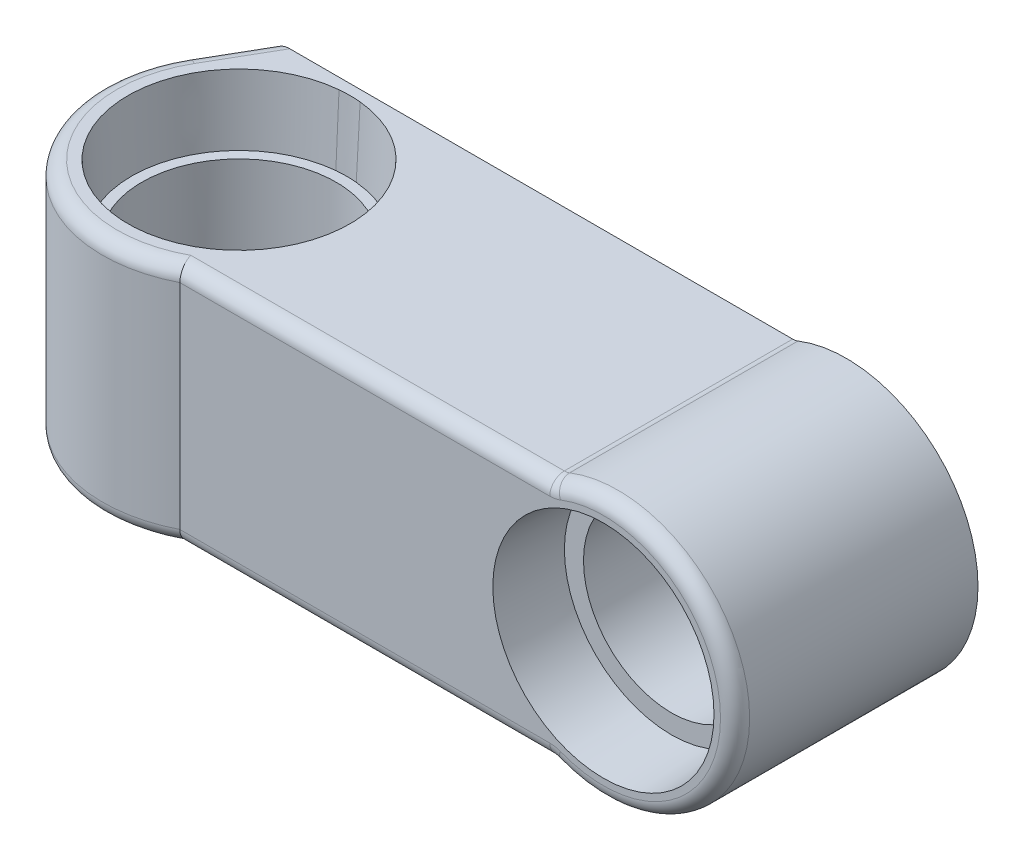
ISO-10303-21;
HEADER;
FILE_DESCRIPTION(('STEP AP214'),'2;1');
FILE_NAME('part.step','',(''),(''),'','','');
FILE_SCHEMA(('AUTOMOTIVE_DESIGN { 1 0 10303 214 1 1 1 1 }'));
ENDSEC;
DATA;
#1=APPLICATION_CONTEXT('core data for automotive mechanical design processes');
#2=APPLICATION_PROTOCOL_DEFINITION('international standard','automotive_design',2000,#1);
#3=PRODUCT_CONTEXT('',#1,'mechanical');
#4=PRODUCT('Part','Part','',(#3));
#5=PRODUCT_RELATED_PRODUCT_CATEGORY('part','',(#4));
#6=PRODUCT_DEFINITION_FORMATION('','',#4);
#7=PRODUCT_DEFINITION_CONTEXT('part definition',#1,'design');
#8=PRODUCT_DEFINITION('design','',#6,#7);
#9=PRODUCT_DEFINITION_SHAPE('','',#8);
#10=(LENGTH_UNIT() NAMED_UNIT(*) SI_UNIT(.MILLI.,.METRE.));
#11=(NAMED_UNIT(*) PLANE_ANGLE_UNIT() SI_UNIT($,.RADIAN.));
#12=(NAMED_UNIT(*) SI_UNIT($,.STERADIAN.) SOLID_ANGLE_UNIT());
#13=UNCERTAINTY_MEASURE_WITH_UNIT(LENGTH_MEASURE(1.E-05),#10,'distance_accuracy_value','');
#14=(GEOMETRIC_REPRESENTATION_CONTEXT(3) GLOBAL_UNCERTAINTY_ASSIGNED_CONTEXT((#13)) GLOBAL_UNIT_ASSIGNED_CONTEXT((#10,
#11,#12)) REPRESENTATION_CONTEXT('',''));
#15=CARTESIAN_POINT('',(0.,0.,0.));
#16=DIRECTION('',(0.,0.,1.));
#17=DIRECTION('',(1.,0.,0.));
#18=AXIS2_PLACEMENT_3D('',#15,#16,#17);
#19=CARTESIAN_POINT('',(50.,0.,25.));
#20=DIRECTION('',(0.,0.,-1.));
#21=DIRECTION('',(-1.,0.,0.));
#22=AXIS2_PLACEMENT_3D('',#19,#20,#21);
#23=CYLINDRICAL_SURFACE('',#22,9.05);
#24=CARTESIAN_POINT('',(50.,0.,18.));
#25=DIRECTION('',(0.,0.,1.));
#26=DIRECTION('',(1.,0.,0.));
#27=AXIS2_PLACEMENT_3D('',#24,#25,#26);
#28=CIRCLE('',#27,9.05);
#29=CARTESIAN_POINT('',(59.05,0.,18.));
#30=VERTEX_POINT('',#29);
#31=EDGE_CURVE('E469',#30,#30,#28,.F.);
#32=ORIENTED_EDGE('',*,*,#31,.F.);
#33=EDGE_LOOP('',(#32));
#34=FACE_BOUND('',#33,.T.);
#35=CARTESIAN_POINT('',(50.,0.,7.));
#36=DIRECTION('',(0.,0.,-1.));
#37=DIRECTION('',(-1.,0.,0.));
#38=AXIS2_PLACEMENT_3D('',#35,#36,#37);
#39=CIRCLE('',#38,9.05);
#40=CARTESIAN_POINT('',(40.95,0.,7.));
#41=VERTEX_POINT('',#40);
#42=EDGE_CURVE('E467',#41,#41,#39,.F.);
#43=ORIENTED_EDGE('',*,*,#42,.F.);
#44=EDGE_LOOP('',(#43));
#45=FACE_BOUND('',#44,.T.);
#46=ADVANCED_FACE('F38',(#34,#45),#23,.F.);
#47=CARTESIAN_POINT('',(0.,-13.5504731747743,12.5));
#48=DIRECTION('',(0.,1.,0.));
#49=DIRECTION('',(0.,0.,1.));
#50=AXIS2_PLACEMENT_3D('',#47,#48,#49);
#51=CYLINDRICAL_SURFACE('',#50,10.);
#52=CARTESIAN_POINT('',(0.,5.5,12.5));
#53=DIRECTION('',(0.,1.,0.));
#54=DIRECTION('',(0.,0.,1.));
#55=AXIS2_PLACEMENT_3D('',#52,#53,#54);
#56=CIRCLE('',#55,10.);
#57=CARTESIAN_POINT('',(0.,5.5,22.5));
#58=VERTEX_POINT('',#57);
#59=EDGE_CURVE('E393',#58,#58,#56,.T.);
#60=ORIENTED_EDGE('',*,*,#59,.T.);
#61=EDGE_LOOP('',(#60));
#62=FACE_BOUND('',#61,.T.);
#63=CARTESIAN_POINT('',(0.,-5.5,12.5));
#64=DIRECTION('',(0.,-1.,0.));
#65=DIRECTION('',(0.,0.,-1.));
#66=AXIS2_PLACEMENT_3D('',#63,#64,#65);
#67=CIRCLE('',#66,10.);
#68=CARTESIAN_POINT('',(0.,-5.5,2.5));
#69=VERTEX_POINT('',#68);
#70=EDGE_CURVE('E438',#69,#69,#67,.F.);
#71=ORIENTED_EDGE('',*,*,#70,.F.);
#72=EDGE_LOOP('',(#71));
#73=FACE_BOUND('',#72,.T.);
#74=ADVANCED_FACE('F447',(#62,#73),#51,.F.);
#75=CARTESIAN_POINT('',(44.4770931566792,-14.,23.5));
#76=DIRECTION('',(0.,0.,-1.));
#77=DIRECTION('',(-1.,0.,0.));
#78=AXIS2_PLACEMENT_3D('',#75,#76,#77);
#79=TOROIDAL_SURFACE('',#78,3.,1.5);
#80=CARTESIAN_POINT('',(44.4770931566792,-14.,25.));
#81=DIRECTION('',(0.,0.,1.));
#82=DIRECTION('',(0.366970554373467,0.930232558139539,0.));
#83=AXIS2_PLACEMENT_3D('',#80,#81,#82);
#84=CIRCLE('',#83,2.99999999999998);
#85=CARTESIAN_POINT('',(44.4770931566792,-11.,25.));
#86=VERTEX_POINT('',#85);
#87=CARTESIAN_POINT('',(45.5780048197996,-11.2093023255814,25.));
#88=VERTEX_POINT('',#87);
#89=EDGE_CURVE('E293',#86,#88,#84,.F.);
#90=ORIENTED_EDGE('',*,*,#89,.F.);
#91=CARTESIAN_POINT('',(44.4770931566792,-11.,23.5));
#92=DIRECTION('',(1.,0.,0.));
#93=DIRECTION('',(0.,0.,-1.));
#94=AXIS2_PLACEMENT_3D('',#91,#92,#93);
#95=CIRCLE('',#94,1.5);
#96=CARTESIAN_POINT('',(44.4770931566792,-12.5,23.5));
#97=VERTEX_POINT('',#96);
#98=EDGE_CURVE('E300',#97,#86,#95,.F.);
#99=ORIENTED_EDGE('',*,*,#98,.F.);
#100=CARTESIAN_POINT('',(44.4770931566792,-14.,23.5));
#101=DIRECTION('',(0.,0.,-1.));
#102=DIRECTION('',(-1.,0.,0.));
#103=AXIS2_PLACEMENT_3D('',#100,#101,#102);
#104=CIRCLE('',#103,1.5);
#105=CARTESIAN_POINT('',(45.0275489882394,-12.6046511627907,23.5));
#106=VERTEX_POINT('',#105);
#107=EDGE_CURVE('E408',#97,#106,#104,.T.);
#108=ORIENTED_EDGE('',*,*,#107,.T.);
#109=CARTESIAN_POINT('',(45.5780048197996,-11.2093023255814,23.5));
#110=DIRECTION('',(-0.930232558139535,0.366970554373477,0.));
#111=DIRECTION('',(-0.366970554373477,-0.930232558139535,0.));
#112=AXIS2_PLACEMENT_3D('',#109,#110,#111);
#113=CIRCLE('',#112,1.5);
#114=EDGE_CURVE('E314',#88,#106,#113,.F.);
#115=ORIENTED_EDGE('',*,*,#114,.F.);
#116=EDGE_LOOP('',(#90,#99,#108,#115));
#117=FACE_BOUND('',#116,.T.);
#118=ADVANCED_FACE('F416',(#117),#79,.T.);
#119=CARTESIAN_POINT('',(44.4770931566792,14.,23.5));
#120=DIRECTION('',(0.,0.,-1.));
#121=DIRECTION('',(-1.,0.,0.));
#122=AXIS2_PLACEMENT_3D('',#119,#120,#121);
#123=TOROIDAL_SURFACE('',#122,3.00000000000002,1.5);
#124=CARTESIAN_POINT('',(44.4770931566792,14.,25.));
#125=DIRECTION('',(0.,0.,1.));
#126=DIRECTION('',(0.,-1.,0.));
#127=AXIS2_PLACEMENT_3D('',#124,#125,#126);
#128=CIRCLE('',#127,3.00000000000002);
#129=CARTESIAN_POINT('',(45.5780048197996,11.2093023255814,25.));
#130=VERTEX_POINT('',#129);
#131=CARTESIAN_POINT('',(44.4770931566792,11.,25.));
#132=VERTEX_POINT('',#131);
#133=EDGE_CURVE('E284',#130,#132,#128,.F.);
#134=ORIENTED_EDGE('',*,*,#133,.F.);
#135=CARTESIAN_POINT('',(45.5780048197996,11.2093023255814,23.5));
#136=DIRECTION('',(0.930232558139535,0.366970554373476,0.));
#137=DIRECTION('',(-0.366970554373476,0.930232558139535,0.));
#138=AXIS2_PLACEMENT_3D('',#135,#136,#137);
#139=CIRCLE('',#138,1.5);
#140=CARTESIAN_POINT('',(45.0275489882394,12.6046511627907,23.5));
#141=VERTEX_POINT('',#140);
#142=EDGE_CURVE('E318',#141,#130,#139,.T.);
#143=ORIENTED_EDGE('',*,*,#142,.F.);
#144=CARTESIAN_POINT('',(44.4770931566792,14.,23.5));
#145=DIRECTION('',(0.,0.,-1.));
#146=DIRECTION('',(-1.,0.,0.));
#147=AXIS2_PLACEMENT_3D('',#144,#145,#146);
#148=CIRCLE('',#147,1.50000000000002);
#149=CARTESIAN_POINT('',(44.4770931566792,12.5,23.5));
#150=VERTEX_POINT('',#149);
#151=EDGE_CURVE('E298',#141,#150,#148,.T.);
#152=ORIENTED_EDGE('',*,*,#151,.T.);
#153=CARTESIAN_POINT('',(44.4770931566792,11.,23.5));
#154=DIRECTION('',(-1.,0.,0.));
#155=DIRECTION('',(0.,0.,1.));
#156=AXIS2_PLACEMENT_3D('',#153,#154,#155);
#157=CIRCLE('',#156,1.5);
#158=EDGE_CURVE('E296',#132,#150,#157,.T.);
#159=ORIENTED_EDGE('',*,*,#158,.F.);
#160=EDGE_LOOP('',(#134,#143,#152,#159));
#161=FACE_BOUND('',#160,.T.);
#162=ADVANCED_FACE('F246',(#161),#123,.T.);
#163=CARTESIAN_POINT('',(27.2381500888347,0.,25.));
#164=DIRECTION('',(0.,0.,1.));
#165=DIRECTION('',(1.,0.,0.));
#166=AXIS2_PLACEMENT_3D('',#163,#164,#165);
#167=PLANE('',#166);
#168=CARTESIAN_POINT('',(50.,0.,25.));
#169=DIRECTION('',(0.,0.,1.));
#170=DIRECTION('',(1.,0.,0.));
#171=AXIS2_PLACEMENT_3D('',#168,#169,#170);
#172=CIRCLE('',#171,11.381);
#173=CARTESIAN_POINT('',(61.381,0.,25.));
#174=VERTEX_POINT('',#173);
#175=EDGE_CURVE('E488',#174,#174,#172,.F.);
#176=ORIENTED_EDGE('',*,*,#175,.T.);
#177=EDGE_LOOP('',(#176));
#178=FACE_BOUND('',#177,.T.);
#179=DIRECTION('',(0.,-1.,0.));
#180=VECTOR('',#179,1.);
#181=CARTESIAN_POINT('',(6.41502143410293,52.239401102684,25.));
#182=LINE('',#181,#180);
#183=CARTESIAN_POINT('',(6.41502143410293,-11.,25.));
#184=VERTEX_POINT('',#183);
#185=CARTESIAN_POINT('',(6.41502143410293,11.,25.));
#186=VERTEX_POINT('',#185);
#187=EDGE_CURVE('E380',#184,#186,#182,.F.);
#188=ORIENTED_EDGE('',*,*,#187,.F.);
#189=DIRECTION('',(1.,0.,0.));
#190=VECTOR('',#189,1.);
#191=CARTESIAN_POINT('',(13.6190750444174,-11.,25.));
#192=LINE('',#191,#190);
#193=EDGE_CURVE('E304',#86,#184,#192,.F.);
#194=ORIENTED_EDGE('',*,*,#193,.F.);
#195=ORIENTED_EDGE('',*,*,#89,.T.);
#196=CARTESIAN_POINT('',(50.,0.,25.));
#197=DIRECTION('',(0.,0.,-1.));
#198=DIRECTION('',(-0.366970554373476,0.930232558139535,0.));
#199=AXIS2_PLACEMENT_3D('',#196,#197,#198);
#200=CIRCLE('',#199,12.05);
#201=EDGE_CURVE('E274',#130,#88,#200,.T.);
#202=ORIENTED_EDGE('',*,*,#201,.F.);
#203=ORIENTED_EDGE('',*,*,#133,.T.);
#204=DIRECTION('',(-1.,0.,0.));
#205=VECTOR('',#204,1.);
#206=CARTESIAN_POINT('',(38.6190750444174,11.,25.));
#207=LINE('',#206,#205);
#208=EDGE_CURVE('E287',#186,#132,#207,.F.);
#209=ORIENTED_EDGE('',*,*,#208,.F.);
#210=EDGE_LOOP('',(#188,#194,#195,#202,#203,#209));
#211=FACE_BOUND('',#210,.T.);
#212=ADVANCED_FACE('F241',(#178,#211),#167,.T.);
#213=CARTESIAN_POINT('',(38.6190750444174,11.,23.5));
#214=DIRECTION('',(-1.,0.,0.));
#215=DIRECTION('',(0.,0.,1.));
#216=AXIS2_PLACEMENT_3D('',#213,#214,#215);
#217=CYLINDRICAL_SURFACE('',#216,1.5);
#218=DIRECTION('',(1.,0.,0.));
#219=VECTOR('',#218,1.);
#220=CARTESIAN_POINT('',(50.,12.5,23.5));
#221=LINE('',#220,#219);
#222=CARTESIAN_POINT('',(6.04172988472673,12.5,23.5));
#223=VERTEX_POINT('',#222);
#224=EDGE_CURVE('E337',#223,#150,#221,.T.);
#225=ORIENTED_EDGE('',*,*,#224,.F.);
#226=CARTESIAN_POINT('',(6.41502143410293,11.,25.));
#227=CARTESIAN_POINT('',(6.4150213839161,11.041331534357,25.0000003289294));
#228=CARTESIAN_POINT('',(6.41460841731845,11.0826429747089,24.9982905799724));
#229=CARTESIAN_POINT('',(6.41296106928046,11.1649639045223,24.9914737640991));
#230=CARTESIAN_POINT('',(6.41172677107181,11.205973424154,24.9863670414237));
#231=CARTESIAN_POINT('',(6.40680605164591,11.3279788822968,24.9660168727333));
#232=CARTESIAN_POINT('',(6.40190175561267,11.4081471508273,24.9457431791111));
#233=CARTESIAN_POINT('',(6.38898261812075,11.5638239528405,24.8924379599916));
#234=CARTESIAN_POINT('',(6.38096711001763,11.6393314836377,24.8594037002744));
#235=CARTESIAN_POINT('',(6.36204823551461,11.7836634078564,24.7816350232128));
#236=CARTESIAN_POINT('',(6.35114490839669,11.8524878921675,24.7369007650196));
#237=CARTESIAN_POINT('',(6.32660136753947,11.9824079486767,24.6365267553904));
#238=CARTESIAN_POINT('',(6.31293082290707,12.0434044161065,24.5807663204095));
#239=CARTESIAN_POINT('',(6.28329156434653,12.1552114723811,24.460333426265));
#240=CARTESIAN_POINT('',(6.26732210164949,12.2060187295971,24.3956580637585));
#241=CARTESIAN_POINT('',(6.23304227134189,12.2974437408128,24.257424075999));
#242=CARTESIAN_POINT('',(6.21468071259519,12.3377525778359,24.1836741060939));
#243=CARTESIAN_POINT('',(6.17644274012454,12.4054160131176,24.0308324132787));
#244=CARTESIAN_POINT('',(6.15656679626909,12.4327746106002,23.9517423481007));
#245=CARTESIAN_POINT('',(6.12130200943006,12.4684296925886,23.8121339805405));
#246=CARTESIAN_POINT('',(6.10614243671778,12.4798728263747,23.7523354041384));
#247=CARTESIAN_POINT('',(6.07550539457527,12.495413368138,23.6319458672536));
#248=CARTESIAN_POINT('',(6.06002855009483,12.4995240322826,23.571356536601));
#249=CARTESIAN_POINT('',(6.04357914950481,12.4999870385534,23.5072090536301));
#250=CARTESIAN_POINT('',(6.04265458940642,12.5000000335432,23.5036043917534));
#251=CARTESIAN_POINT('',(6.04172988472673,12.5,23.5));
#252=B_SPLINE_CURVE_WITH_KNOTS('',3,(#226,#227,#228,#229,#230,#231,#232,#233,#234,#235,#236,
#237,#238,#239,#240,#241,#242,#243,#244,#245,#246,#247,#248,#249,#250,#251),.UNSPECIFIED.,.F.,
.F.,(4,2,2,2,2,2,2,2,2,2,2,2,4),(0.,0.123917438025907,0.247822320479427,0.495053351985794,
0.742337387354842,0.989618059178567,1.23977218077668,1.49000796392072,1.74693739912239,
2.00378743889704,2.19162530275369,2.37912323427178,2.39028722542629),.UNSPECIFIED.);
#253=EDGE_CURVE('E176',#223,#186,#252,.F.);
#254=ORIENTED_EDGE('',*,*,#253,.T.);
#255=ORIENTED_EDGE('',*,*,#208,.T.);
#256=ORIENTED_EDGE('',*,*,#158,.T.);
#257=EDGE_LOOP('',(#225,#254,#255,#256));
#258=FACE_BOUND('',#257,.T.);
#259=ADVANCED_FACE('F233',(#258),#217,.T.);
#260=CARTESIAN_POINT('',(13.6190750444174,-11.,23.5));
#261=DIRECTION('',(1.,0.,0.));
#262=DIRECTION('',(0.,0.,-1.));
#263=AXIS2_PLACEMENT_3D('',#260,#261,#262);
#264=CYLINDRICAL_SURFACE('',#263,1.5);
#265=ORIENTED_EDGE('',*,*,#193,.T.);
#266=CARTESIAN_POINT('',(6.41502143410293,-11.,25.));
#267=CARTESIAN_POINT('',(6.4150213839161,-11.041331534357,25.0000003289294));
#268=CARTESIAN_POINT('',(6.41460841731845,-11.0826429747089,24.9982905799724));
#269=CARTESIAN_POINT('',(6.41296106928046,-11.1649639045223,24.9914737640991));
#270=CARTESIAN_POINT('',(6.41172677107181,-11.205973424154,24.9863670414237));
#271=CARTESIAN_POINT('',(6.40680605164591,-11.3279788822968,24.9660168727333));
#272=CARTESIAN_POINT('',(6.40190175561267,-11.4081471508273,24.9457431791111));
#273=CARTESIAN_POINT('',(6.38898261812075,-11.5638239528405,24.8924379599916));
#274=CARTESIAN_POINT('',(6.38096711001763,-11.6393314836377,24.8594037002744));
#275=CARTESIAN_POINT('',(6.3620482355146,-11.7836634078564,24.7816350232128));
#276=CARTESIAN_POINT('',(6.35114490839668,-11.8524878921675,24.7369007650196));
#277=CARTESIAN_POINT('',(6.32660136753947,-11.9824079486766,24.6365267553904));
#278=CARTESIAN_POINT('',(6.31293082290708,-12.0434044161065,24.5807663204095));
#279=CARTESIAN_POINT('',(6.28329156434649,-12.155211472381,24.460333426265));
#280=CARTESIAN_POINT('',(6.26732210164939,-12.2060187295971,24.3956580637585));
#281=CARTESIAN_POINT('',(6.23304227134196,-12.2974437408128,24.257424075999));
#282=CARTESIAN_POINT('',(6.21468071259549,-12.3377525778359,24.1836741060938));
#283=CARTESIAN_POINT('',(6.17644274012418,-12.4054160131176,24.0308324132788));
#284=CARTESIAN_POINT('',(6.15656679626784,-12.4327746106002,23.9517423481011));
#285=CARTESIAN_POINT('',(6.12130200943089,-12.4684296925886,23.8121339805403));
#286=CARTESIAN_POINT('',(6.10614243672061,-12.4798728263747,23.7523354041377));
#287=CARTESIAN_POINT('',(6.07550539457224,-12.495413368138,23.6319458672544));
#288=CARTESIAN_POINT('',(6.06002855008397,-12.4995240322826,23.5713565366038));
#289=CARTESIAN_POINT('',(6.04357914950355,-12.4999870385534,23.5072090536304));
#290=CARTESIAN_POINT('',(6.04265458940575,-12.5000000335432,23.5036043917535));
#291=CARTESIAN_POINT('',(6.04172988472673,-12.5,23.5));
#292=B_SPLINE_CURVE_WITH_KNOTS('',3,(#266,#267,#268,#269,#270,#271,#272,#273,#274,#275,#276,
#277,#278,#279,#280,#281,#282,#283,#284,#285,#286,#287,#288,#289,#290,#291),.UNSPECIFIED.,.F.,
.F.,(4,2,2,2,2,2,2,2,2,2,2,2,4),(0.,0.123917438025909,0.247822320479427,0.495053351985796,
0.742337387354841,0.989618059178565,1.23977218077667,1.49000796392073,1.74693739912242,
2.00378743889705,2.19162530275367,2.37912323427179,2.39028722542629),.UNSPECIFIED.);
#293=CARTESIAN_POINT('',(6.04172988472673,-12.5,23.5));
#294=VERTEX_POINT('',#293);
#295=EDGE_CURVE('E209',#184,#294,#292,.T.);
#296=ORIENTED_EDGE('',*,*,#295,.T.);
#297=DIRECTION('',(1.,0.,0.));
#298=VECTOR('',#297,1.);
#299=CARTESIAN_POINT('',(0.,-12.5,23.5));
#300=LINE('',#299,#298);
#301=EDGE_CURVE('E336',#97,#294,#300,.F.);
#302=ORIENTED_EDGE('',*,*,#301,.F.);
#303=ORIENTED_EDGE('',*,*,#98,.T.);
#304=EDGE_LOOP('',(#265,#296,#302,#303));
#305=FACE_BOUND('',#304,.T.);
#306=ADVANCED_FACE('F228',(#305),#264,.T.);
#307=CARTESIAN_POINT('',(50.,0.,23.5));
#308=DIRECTION('',(0.,0.,-1.));
#309=DIRECTION('',(-1.,0.,0.));
#310=AXIS2_PLACEMENT_3D('',#307,#308,#309);
#311=TOROIDAL_SURFACE('',#310,12.05,1.5);
#312=ORIENTED_EDGE('',*,*,#142,.T.);
#313=ORIENTED_EDGE('',*,*,#201,.T.);
#314=ORIENTED_EDGE('',*,*,#114,.T.);
#315=CARTESIAN_POINT('',(50.,0.,23.5));
#316=DIRECTION('',(0.,0.,-1.));
#317=DIRECTION('',(-1.,0.,0.));
#318=AXIS2_PLACEMENT_3D('',#315,#316,#317);
#319=CIRCLE('',#318,13.55);
#320=EDGE_CURVE('E326',#141,#106,#319,.T.);
#321=ORIENTED_EDGE('',*,*,#320,.F.);
#322=EDGE_LOOP('',(#312,#313,#314,#321));
#323=FACE_BOUND('',#322,.T.);
#324=ADVANCED_FACE('F232',(#323),#311,.T.);
#325=CARTESIAN_POINT('',(44.4770931566792,-14.,25.));
#326=DIRECTION('',(0.,0.,1.));
#327=DIRECTION('',(1.,0.,0.));
#328=AXIS2_PLACEMENT_3D('',#325,#326,#327);
#329=CYLINDRICAL_SURFACE('',#328,1.5);
#330=DIRECTION('',(0.,0.,-1.));
#331=VECTOR('',#330,1.);
#332=CARTESIAN_POINT('',(44.4770931566792,-12.5,0.));
#333=LINE('',#332,#331);
#334=CARTESIAN_POINT('',(44.4770931566792,-12.5,0.));
#335=VERTEX_POINT('',#334);
#336=EDGE_CURVE('E331',#335,#97,#333,.F.);
#337=ORIENTED_EDGE('',*,*,#336,.F.);
#338=CARTESIAN_POINT('',(44.4770931566792,-14.,0.));
#339=DIRECTION('',(0.,0.,1.));
#340=DIRECTION('',(1.,0.,0.));
#341=AXIS2_PLACEMENT_3D('',#338,#339,#340);
#342=CIRCLE('',#341,1.5);
#343=CARTESIAN_POINT('',(45.0275489882394,-12.6046511627907,0.));
#344=VERTEX_POINT('',#343);
#345=EDGE_CURVE('E383',#335,#344,#342,.F.);
#346=ORIENTED_EDGE('',*,*,#345,.T.);
#347=DIRECTION('',(0.,0.,-1.));
#348=VECTOR('',#347,1.);
#349=CARTESIAN_POINT('',(45.0275489882394,-12.6046511627907,25.));
#350=LINE('',#349,#348);
#351=EDGE_CURVE('E330',#106,#344,#350,.T.);
#352=ORIENTED_EDGE('',*,*,#351,.F.);
#353=ORIENTED_EDGE('',*,*,#107,.F.);
#354=EDGE_LOOP('',(#337,#346,#352,#353));
#355=FACE_BOUND('',#354,.T.);
#356=ADVANCED_FACE('F410',(#355),#329,.F.);
#357=CARTESIAN_POINT('',(44.4770931566792,14.,25.));
#358=DIRECTION('',(0.,0.,-1.));
#359=DIRECTION('',(-1.,0.,0.));
#360=AXIS2_PLACEMENT_3D('',#357,#358,#359);
#361=CYLINDRICAL_SURFACE('',#360,1.5);
#362=DIRECTION('',(0.,0.,-1.));
#363=VECTOR('',#362,1.);
#364=CARTESIAN_POINT('',(45.0275489882394,12.6046511627907,25.));
#365=LINE('',#364,#363);
#366=CARTESIAN_POINT('',(45.0275489882394,12.6046511627907,0.));
#367=VERTEX_POINT('',#366);
#368=EDGE_CURVE('E350',#367,#141,#365,.F.);
#369=ORIENTED_EDGE('',*,*,#368,.F.);
#370=CARTESIAN_POINT('',(44.4770931566792,14.,0.));
#371=DIRECTION('',(0.,0.,1.));
#372=DIRECTION('',(1.,0.,0.));
#373=AXIS2_PLACEMENT_3D('',#370,#371,#372);
#374=CIRCLE('',#373,1.5);
#375=CARTESIAN_POINT('',(44.4770931566792,12.5,0.));
#376=VERTEX_POINT('',#375);
#377=EDGE_CURVE('E187',#367,#376,#374,.F.);
#378=ORIENTED_EDGE('',*,*,#377,.T.);
#379=DIRECTION('',(0.,0.,1.));
#380=VECTOR('',#379,1.);
#381=CARTESIAN_POINT('',(44.4770931566792,12.5,0.));
#382=LINE('',#381,#380);
#383=EDGE_CURVE('E185',#150,#376,#382,.F.);
#384=ORIENTED_EDGE('',*,*,#383,.F.);
#385=ORIENTED_EDGE('',*,*,#151,.F.);
#386=EDGE_LOOP('',(#369,#378,#384,#385));
#387=FACE_BOUND('',#386,.T.);
#388=ADVANCED_FACE('F507',(#387),#361,.F.);
#389=CARTESIAN_POINT('',(50.,12.5,0.));
#390=DIRECTION('',(0.,1.,0.));
#391=DIRECTION('',(0.,0.,1.));
#392=AXIS2_PLACEMENT_3D('',#389,#390,#391);
#393=PLANE('',#392);
#394=CARTESIAN_POINT('',(0.,12.5,12.5));
#395=DIRECTION('',(0.,1.,0.));
#396=DIRECTION('',(0.,0.,1.));
#397=AXIS2_PLACEMENT_3D('',#394,#395,#396);
#398=CIRCLE('',#397,11.4310000000001);
#399=CARTESIAN_POINT('',(1.08620361990951,12.5,1.1207239819004));
#400=VERTEX_POINT('',#399);
#401=CARTESIAN_POINT('',(-1.08620361990951,12.5,1.1207239819004));
#402=VERTEX_POINT('',#401);
#403=EDGE_CURVE('E80',#400,#402,#398,.F.);
#404=ORIENTED_EDGE('',*,*,#403,.T.);
#405=CARTESIAN_POINT('',(0.,12.5,12.5));
#406=DIRECTION('',(0.,1.,0.));
#407=DIRECTION('',(0.,0.,1.));
#408=AXIS2_PLACEMENT_3D('',#405,#406,#407);
#409=CIRCLE('',#408,11.4310000000001);
#410=EDGE_CURVE('E486',#402,#400,#409,.F.);
#411=ORIENTED_EDGE('',*,*,#410,.T.);
#412=EDGE_LOOP('',(#404,#411));
#413=FACE_BOUND('',#412,.T.);
#414=DIRECTION('',(1.,0.,0.));
#415=VECTOR('',#414,1.);
#416=CARTESIAN_POINT('',(50.,12.5,0.));
#417=LINE('',#416,#415);
#418=CARTESIAN_POINT('',(-7.27461339178925,12.5,0.));
#419=VERTEX_POINT('',#418);
#420=EDGE_CURVE('E166',#419,#376,#417,.T.);
#421=ORIENTED_EDGE('',*,*,#420,.F.);
#422=DIRECTION('',(0.500000000000005,0.,-0.866025403784436));
#423=VECTOR('',#422,1.);
#424=CARTESIAN_POINT('',(-10.8686188174947,12.5,6.22499999999995));
#425=LINE('',#424,#423);
#426=CARTESIAN_POINT('',(-10.8686188174947,12.5,6.22499999999995));
#427=VERTEX_POINT('',#426);
#428=EDGE_CURVE('E182',#419,#427,#425,.F.);
#429=ORIENTED_EDGE('',*,*,#428,.T.);
#430=CARTESIAN_POINT('',(0.,12.5,12.5));
#431=DIRECTION('',(0.,1.,0.));
#432=DIRECTION('',(0.,0.,1.));
#433=AXIS2_PLACEMENT_3D('',#430,#431,#432);
#434=CIRCLE('',#433,12.55);
#435=EDGE_CURVE('E195',#427,#223,#434,.T.);
#436=ORIENTED_EDGE('',*,*,#435,.T.);
#437=ORIENTED_EDGE('',*,*,#224,.T.);
#438=ORIENTED_EDGE('',*,*,#383,.T.);
#439=EDGE_LOOP('',(#421,#429,#436,#437,#438));
#440=FACE_BOUND('',#439,.T.);
#441=ADVANCED_FACE('F180',(#413,#440),#393,.T.);
#442=CARTESIAN_POINT('',(0.,-12.5,0.));
#443=DIRECTION('',(0.,-1.,0.));
#444=DIRECTION('',(0.,0.,-1.));
#445=AXIS2_PLACEMENT_3D('',#442,#443,#444);
#446=PLANE('',#445);
#447=CARTESIAN_POINT('',(0.,-12.5,12.5));
#448=DIRECTION('',(0.,-1.,0.));
#449=DIRECTION('',(0.,0.,-1.));
#450=AXIS2_PLACEMENT_3D('',#447,#448,#449);
#451=CIRCLE('',#450,11.4310000000001);
#452=CARTESIAN_POINT('',(-1.08620361990951,-12.5,1.1207239819004));
#453=VERTEX_POINT('',#452);
#454=CARTESIAN_POINT('',(1.0862036199095,-12.5,1.1207239819004));
#455=VERTEX_POINT('',#454);
#456=EDGE_CURVE('E480',#453,#455,#451,.F.);
#457=ORIENTED_EDGE('',*,*,#456,.T.);
#458=CARTESIAN_POINT('',(0.,-12.5,12.5));
#459=DIRECTION('',(0.,-1.,0.));
#460=DIRECTION('',(0.,0.,-1.));
#461=AXIS2_PLACEMENT_3D('',#458,#459,#460);
#462=CIRCLE('',#461,11.4310000000001);
#463=EDGE_CURVE('E482',#455,#453,#462,.F.);
#464=ORIENTED_EDGE('',*,*,#463,.T.);
#465=EDGE_LOOP('',(#457,#464));
#466=FACE_BOUND('',#465,.T.);
#467=DIRECTION('',(-1.,0.,0.));
#468=VECTOR('',#467,1.);
#469=CARTESIAN_POINT('',(0.,-12.5,0.));
#470=LINE('',#469,#468);
#471=CARTESIAN_POINT('',(-7.27461339178925,-12.5,0.));
#472=VERTEX_POINT('',#471);
#473=EDGE_CURVE('E362',#335,#472,#470,.T.);
#474=ORIENTED_EDGE('',*,*,#473,.F.);
#475=ORIENTED_EDGE('',*,*,#336,.T.);
#476=ORIENTED_EDGE('',*,*,#301,.T.);
#477=CARTESIAN_POINT('',(0.,-12.5,12.5));
#478=DIRECTION('',(0.,-1.,0.));
#479=DIRECTION('',(0.,0.,-1.));
#480=AXIS2_PLACEMENT_3D('',#477,#478,#479);
#481=CIRCLE('',#480,12.55);
#482=CARTESIAN_POINT('',(-10.8686188174947,-12.5,6.22499999999995));
#483=VERTEX_POINT('',#482);
#484=EDGE_CURVE('E353',#294,#483,#481,.T.);
#485=ORIENTED_EDGE('',*,*,#484,.T.);
#486=DIRECTION('',(-0.500000000000005,0.,0.866025403784436));
#487=VECTOR('',#486,1.);
#488=CARTESIAN_POINT('',(-6.81273317643755,-12.5,-0.79999999999999));
#489=LINE('',#488,#487);
#490=EDGE_CURVE('E203',#483,#472,#489,.F.);
#491=ORIENTED_EDGE('',*,*,#490,.T.);
#492=EDGE_LOOP('',(#474,#475,#476,#485,#491));
#493=FACE_BOUND('',#492,.T.);
#494=ADVANCED_FACE('F361',(#466,#493),#446,.T.);
#495=CARTESIAN_POINT('',(50.,0.,25.));
#496=DIRECTION('',(0.,0.,-1.));
#497=DIRECTION('',(-1.,0.,0.));
#498=AXIS2_PLACEMENT_3D('',#495,#496,#497);
#499=CYLINDRICAL_SURFACE('',#498,13.55);
#500=CARTESIAN_POINT('',(50.,0.,0.));
#501=DIRECTION('',(0.,0.,1.));
#502=DIRECTION('',(1.,0.,0.));
#503=AXIS2_PLACEMENT_3D('',#500,#501,#502);
#504=CIRCLE('',#503,13.55);
#505=EDGE_CURVE('E777',#367,#344,#504,.F.);
#506=ORIENTED_EDGE('',*,*,#505,.F.);
#507=ORIENTED_EDGE('',*,*,#368,.T.);
#508=ORIENTED_EDGE('',*,*,#320,.T.);
#509=ORIENTED_EDGE('',*,*,#351,.T.);
#510=EDGE_LOOP('',(#506,#507,#508,#509));
#511=FACE_BOUND('',#510,.T.);
#512=ADVANCED_FACE('F513',(#511),#499,.T.);
#513=CARTESIAN_POINT('',(0.,5.5,12.5));
#514=DIRECTION('',(0.,1.,0.));
#515=DIRECTION('',(0.,0.,1.));
#516=AXIS2_PLACEMENT_3D('',#513,#514,#515);
#517=PLANE('',#516);
#518=CARTESIAN_POINT('',(0.,5.5,12.5));
#519=DIRECTION('',(0.,1.,0.));
#520=DIRECTION('',(0.,0.,1.));
#521=AXIS2_PLACEMENT_3D('',#518,#519,#520);
#522=CIRCLE('',#521,11.0641455450188);
#523=CARTESIAN_POINT('',(1.05134414681174,5.5,1.48591846197225));
#524=VERTEX_POINT('',#523);
#525=CARTESIAN_POINT('',(-1.05134414681174,5.5,1.48591846197225));
#526=VERTEX_POINT('',#525);
#527=EDGE_CURVE('E497',#524,#526,#522,.T.);
#528=ORIENTED_EDGE('',*,*,#527,.T.);
#529=CARTESIAN_POINT('',(0.,5.5,12.5));
#530=DIRECTION('',(0.,1.,0.));
#531=DIRECTION('',(0.,0.,1.));
#532=AXIS2_PLACEMENT_3D('',#529,#530,#531);
#533=CIRCLE('',#532,11.0641455450188);
#534=EDGE_CURVE('E48',#526,#524,#533,.T.);
#535=ORIENTED_EDGE('',*,*,#534,.T.);
#536=EDGE_LOOP('',(#528,#535));
#537=FACE_BOUND('',#536,.T.);
#538=ORIENTED_EDGE('',*,*,#59,.F.);
#539=EDGE_LOOP('',(#538));
#540=FACE_BOUND('',#539,.T.);
#541=ADVANCED_FACE('F448',(#537,#540),#517,.T.);
#542=CARTESIAN_POINT('',(0.,-5.5,12.5));
#543=DIRECTION('',(0.,-1.,0.));
#544=DIRECTION('',(0.,0.,-1.));
#545=AXIS2_PLACEMENT_3D('',#542,#543,#544);
#546=PLANE('',#545);
#547=CARTESIAN_POINT('',(0.,-5.5,12.5));
#548=DIRECTION('',(0.,-1.,0.));
#549=DIRECTION('',(0.,0.,-1.));
#550=AXIS2_PLACEMENT_3D('',#547,#548,#549);
#551=CIRCLE('',#550,11.0641455450188);
#552=CARTESIAN_POINT('',(-1.05134414681174,-5.5,1.48591846197225));
#553=VERTEX_POINT('',#552);
#554=CARTESIAN_POINT('',(1.05134414681174,-5.5,1.48591846197225));
#555=VERTEX_POINT('',#554);
#556=EDGE_CURVE('E494',#553,#555,#551,.T.);
#557=ORIENTED_EDGE('',*,*,#556,.T.);
#558=CARTESIAN_POINT('',(0.,-5.5,12.5));
#559=DIRECTION('',(0.,-1.,0.));
#560=DIRECTION('',(0.,0.,-1.));
#561=AXIS2_PLACEMENT_3D('',#558,#559,#560);
#562=CIRCLE('',#561,11.0641455450188);
#563=EDGE_CURVE('E73',#555,#553,#562,.T.);
#564=ORIENTED_EDGE('',*,*,#563,.T.);
#565=EDGE_LOOP('',(#557,#564));
#566=FACE_BOUND('',#565,.T.);
#567=ORIENTED_EDGE('',*,*,#70,.T.);
#568=EDGE_LOOP('',(#567));
#569=FACE_BOUND('',#568,.T.);
#570=ADVANCED_FACE('F576',(#566,#569),#546,.T.);
#571=CARTESIAN_POINT('',(0.,52.239401102684,12.5));
#572=DIRECTION('',(0.,-1.,0.));
#573=DIRECTION('',(0.,0.,-1.));
#574=AXIS2_PLACEMENT_3D('',#571,#572,#573);
#575=CYLINDRICAL_SURFACE('',#574,14.05);
#576=DIRECTION('',(0.,1.,0.));
#577=VECTOR('',#576,1.);
#578=CARTESIAN_POINT('',(-12.1676569231713,-13.5504731747743,5.47499999999994));
#579=LINE('',#578,#577);
#580=CARTESIAN_POINT('',(-12.1676569231713,-11.,5.47499999999994));
#581=VERTEX_POINT('',#580);
#582=CARTESIAN_POINT('',(-12.1676569231713,11.,5.47499999999994));
#583=VERTEX_POINT('',#582);
#584=EDGE_CURVE('E377',#581,#583,#579,.T.);
#585=ORIENTED_EDGE('',*,*,#584,.F.);
#586=CARTESIAN_POINT('',(0.,-11.,12.5));
#587=DIRECTION('',(0.,-1.,0.));
#588=DIRECTION('',(0.,0.,-1.));
#589=AXIS2_PLACEMENT_3D('',#586,#587,#588);
#590=CIRCLE('',#589,14.05);
#591=EDGE_CURVE('E200',#581,#184,#590,.F.);
#592=ORIENTED_EDGE('',*,*,#591,.T.);
#593=ORIENTED_EDGE('',*,*,#187,.T.);
#594=CARTESIAN_POINT('',(0.,11.,12.5));
#595=DIRECTION('',(0.,1.,0.));
#596=DIRECTION('',(0.,0.,1.));
#597=AXIS2_PLACEMENT_3D('',#594,#595,#596);
#598=CIRCLE('',#597,14.05);
#599=EDGE_CURVE('E194',#186,#583,#598,.F.);
#600=ORIENTED_EDGE('',*,*,#599,.T.);
#601=EDGE_LOOP('',(#585,#592,#593,#600));
#602=FACE_BOUND('',#601,.T.);
#603=ADVANCED_FACE('F582',(#602),#575,.T.);
#604=CARTESIAN_POINT('',(-8.1117712821142,-13.5504731747743,-1.55));
#605=DIRECTION('',(0.866025403784436,0.,0.500000000000004));
#606=DIRECTION('',(0.500000000000005,0.,-0.866025403784436));
#607=AXIS2_PLACEMENT_3D('',#604,#605,#606);
#608=PLANE('',#607);
#609=DIRECTION('',(0.500000000000005,0.,-0.866025403784436));
#610=VECTOR('',#609,1.);
#611=CARTESIAN_POINT('',(-8.1117712821142,11.,-1.55));
#612=LINE('',#611,#610);
#613=CARTESIAN_POINT('',(-9.00666419935813,11.,0.));
#614=VERTEX_POINT('',#613);
#615=EDGE_CURVE('E346',#583,#614,#612,.T.);
#616=ORIENTED_EDGE('',*,*,#615,.T.);
#617=DIRECTION('',(0.,-1.,0.));
#618=VECTOR('',#617,1.);
#619=CARTESIAN_POINT('',(-9.00666419935813,-13.5504731747743,0.));
#620=LINE('',#619,#618);
#621=CARTESIAN_POINT('',(-9.00666419935813,-11.,0.));
#622=VERTEX_POINT('',#621);
#623=EDGE_CURVE('E169',#614,#622,#620,.T.);
#624=ORIENTED_EDGE('',*,*,#623,.T.);
#625=DIRECTION('',(-0.500000000000005,0.,0.866025403784436));
#626=VECTOR('',#625,1.);
#627=CARTESIAN_POINT('',(-12.1676569231713,-11.,5.47499999999994));
#628=LINE('',#627,#626);
#629=EDGE_CURVE('E349',#622,#581,#628,.T.);
#630=ORIENTED_EDGE('',*,*,#629,.T.);
#631=ORIENTED_EDGE('',*,*,#584,.T.);
#632=EDGE_LOOP('',(#616,#624,#630,#631));
#633=FACE_BOUND('',#632,.T.);
#634=ADVANCED_FACE('F612',(#633),#608,.F.);
#635=CARTESIAN_POINT('',(0.,-11.,12.5));
#636=DIRECTION('',(0.,-1.,0.));
#637=DIRECTION('',(0.,0.,-1.));
#638=AXIS2_PLACEMENT_3D('',#635,#636,#637);
#639=TOROIDAL_SURFACE('',#638,12.55,1.5);
#640=ORIENTED_EDGE('',*,*,#295,.F.);
#641=ORIENTED_EDGE('',*,*,#591,.F.);
#642=CARTESIAN_POINT('',(-10.8686188174947,-11.,6.22499999999995));
#643=DIRECTION('',(0.500000000000005,0.,-0.866025403784436));
#644=DIRECTION('',(-0.866025403784436,0.,-0.500000000000005));
#645=AXIS2_PLACEMENT_3D('',#642,#643,#644);
#646=CIRCLE('',#645,1.5);
#647=EDGE_CURVE('E371',#483,#581,#646,.T.);
#648=ORIENTED_EDGE('',*,*,#647,.F.);
#649=ORIENTED_EDGE('',*,*,#484,.F.);
#650=EDGE_LOOP('',(#640,#641,#648,#649));
#651=FACE_BOUND('',#650,.T.);
#652=ADVANCED_FACE('F224',(#651),#639,.T.);
#653=CARTESIAN_POINT('',(-6.81273317643755,-11.,-0.79999999999999));
#654=DIRECTION('',(0.500000000000005,0.,-0.866025403784436));
#655=DIRECTION('',(-0.866025403784436,0.,-0.500000000000004));
#656=AXIS2_PLACEMENT_3D('',#653,#654,#655);
#657=CYLINDRICAL_SURFACE('',#656,1.5);
#658=CARTESIAN_POINT('',(-7.27461339178925,-11.,0.));
#659=DIRECTION('',(0.,0.,1.));
#660=DIRECTION('',(1.,0.,0.));
#661=AXIS2_PLACEMENT_3D('',#658,#659,#660);
#662=ELLIPSE('',#661,1.73205080756888,1.5);
#663=EDGE_CURVE('E373',#472,#622,#662,.F.);
#664=ORIENTED_EDGE('',*,*,#663,.F.);
#665=ORIENTED_EDGE('',*,*,#490,.F.);
#666=ORIENTED_EDGE('',*,*,#647,.T.);
#667=ORIENTED_EDGE('',*,*,#629,.F.);
#668=EDGE_LOOP('',(#664,#665,#666,#667));
#669=FACE_BOUND('',#668,.T.);
#670=ADVANCED_FACE('F369',(#669),#657,.T.);
#671=CARTESIAN_POINT('',(0.,11.,12.5));
#672=DIRECTION('',(0.,1.,0.));
#673=DIRECTION('',(0.,0.,1.));
#674=AXIS2_PLACEMENT_3D('',#671,#672,#673);
#675=TOROIDAL_SURFACE('',#674,12.55,1.5);
#676=ORIENTED_EDGE('',*,*,#253,.F.);
#677=ORIENTED_EDGE('',*,*,#435,.F.);
#678=CARTESIAN_POINT('',(-10.8686188174947,11.,6.22499999999995));
#679=DIRECTION('',(0.500000000000004,0.,-0.866025403784436));
#680=DIRECTION('',(-0.866025403784436,0.,-0.500000000000004));
#681=AXIS2_PLACEMENT_3D('',#678,#679,#680);
#682=CIRCLE('',#681,1.5);
#683=EDGE_CURVE('E192',#583,#427,#682,.T.);
#684=ORIENTED_EDGE('',*,*,#683,.F.);
#685=ORIENTED_EDGE('',*,*,#599,.F.);
#686=EDGE_LOOP('',(#676,#677,#684,#685));
#687=FACE_BOUND('',#686,.T.);
#688=ADVANCED_FACE('F657',(#687),#675,.T.);
#689=CARTESIAN_POINT('',(-6.81273317643755,11.,-0.79999999999999));
#690=DIRECTION('',(-0.500000000000005,0.,0.866025403784436));
#691=DIRECTION('',(0.866025403784436,0.,0.500000000000004));
#692=AXIS2_PLACEMENT_3D('',#689,#690,#691);
#693=CYLINDRICAL_SURFACE('',#692,1.5);
#694=CARTESIAN_POINT('',(-7.27461339178925,11.,0.));
#695=DIRECTION('',(0.,0.,1.));
#696=DIRECTION('',(-1.,0.,0.));
#697=AXIS2_PLACEMENT_3D('',#694,#695,#696);
#698=ELLIPSE('',#697,1.73205080756888,1.5);
#699=EDGE_CURVE('E163',#614,#419,#698,.F.);
#700=ORIENTED_EDGE('',*,*,#699,.F.);
#701=ORIENTED_EDGE('',*,*,#615,.F.);
#702=ORIENTED_EDGE('',*,*,#683,.T.);
#703=ORIENTED_EDGE('',*,*,#428,.F.);
#704=EDGE_LOOP('',(#700,#701,#702,#703));
#705=FACE_BOUND('',#704,.T.);
#706=ADVANCED_FACE('F190',(#705),#693,.T.);
#707=CARTESIAN_POINT('',(27.2381500888347,0.,0.));
#708=DIRECTION('',(0.,0.,1.));
#709=DIRECTION('',(1.,0.,0.));
#710=AXIS2_PLACEMENT_3D('',#707,#708,#709);
#711=PLANE('',#710);
#712=CARTESIAN_POINT('',(50.,0.,0.));
#713=DIRECTION('',(0.,0.,1.));
#714=DIRECTION('',(1.,0.,0.));
#715=AXIS2_PLACEMENT_3D('',#712,#713,#714);
#716=CIRCLE('',#715,11.381);
#717=CARTESIAN_POINT('',(61.381,0.,0.));
#718=VERTEX_POINT('',#717);
#719=EDGE_CURVE('E175',#718,#718,#716,.T.);
#720=ORIENTED_EDGE('',*,*,#719,.T.);
#721=EDGE_LOOP('',(#720));
#722=FACE_BOUND('',#721,.T.);
#723=ORIENTED_EDGE('',*,*,#473,.T.);
#724=ORIENTED_EDGE('',*,*,#663,.T.);
#725=ORIENTED_EDGE('',*,*,#623,.F.);
#726=ORIENTED_EDGE('',*,*,#699,.T.);
#727=ORIENTED_EDGE('',*,*,#420,.T.);
#728=ORIENTED_EDGE('',*,*,#377,.F.);
#729=ORIENTED_EDGE('',*,*,#505,.T.);
#730=ORIENTED_EDGE('',*,*,#345,.F.);
#731=EDGE_LOOP('',(#723,#724,#725,#726,#727,#728,#729,#730));
#732=FACE_BOUND('',#731,.T.);
#733=ADVANCED_FACE('F165',(#722,#732),#711,.F.);
#734=CARTESIAN_POINT('',(50.,0.,18.));
#735=DIRECTION('',(0.,0.,1.));
#736=DIRECTION('',(1.,0.,0.));
#737=AXIS2_PLACEMENT_3D('',#734,#735,#736);
#738=PLANE('',#737);
#739=CARTESIAN_POINT('',(50.,0.,18.));
#740=DIRECTION('',(0.,0.,1.));
#741=DIRECTION('',(1.,0.,0.));
#742=AXIS2_PLACEMENT_3D('',#739,#740,#741);
#743=CIRCLE('',#742,11.0141455450188);
#744=CARTESIAN_POINT('',(61.0141455450188,0.,18.));
#745=VERTEX_POINT('',#744);
#746=EDGE_CURVE('E12',#745,#745,#743,.T.);
#747=ORIENTED_EDGE('',*,*,#746,.T.);
#748=EDGE_LOOP('',(#747));
#749=FACE_BOUND('',#748,.T.);
#750=ORIENTED_EDGE('',*,*,#31,.T.);
#751=EDGE_LOOP('',(#750));
#752=FACE_BOUND('',#751,.T.);
#753=ADVANCED_FACE('F687',(#749,#752),#738,.T.);
#754=CARTESIAN_POINT('',(50.,0.,7.));
#755=DIRECTION('',(0.,0.,-1.));
#756=DIRECTION('',(-1.,0.,0.));
#757=AXIS2_PLACEMENT_3D('',#754,#755,#756);
#758=PLANE('',#757);
#759=CARTESIAN_POINT('',(50.,0.,7.));
#760=DIRECTION('',(0.,0.,-1.));
#761=DIRECTION('',(-1.,0.,0.));
#762=AXIS2_PLACEMENT_3D('',#759,#760,#761);
#763=CIRCLE('',#762,11.0141455450188);
#764=CARTESIAN_POINT('',(38.9858544549812,0.,7.));
#765=VERTEX_POINT('',#764);
#766=EDGE_CURVE('E491',#765,#765,#763,.T.);
#767=ORIENTED_EDGE('',*,*,#766,.T.);
#768=EDGE_LOOP('',(#767));
#769=FACE_BOUND('',#768,.T.);
#770=ORIENTED_EDGE('',*,*,#42,.T.);
#771=EDGE_LOOP('',(#770));
#772=FACE_BOUND('',#771,.T.);
#773=ADVANCED_FACE('F680',(#769,#772),#758,.T.);
#774=CARTESIAN_POINT('',(50.,0.,7.26991307802587));
#775=DIRECTION('',(0.,0.,-1.));
#776=DIRECTION('',(-1.,0.,0.));
#777=AXIS2_PLACEMENT_3D('',#774,#775,#776);
#778=CONICAL_SURFACE('',#777,11.,0.0523598775598267);
#779=ORIENTED_EDGE('',*,*,#719,.F.);
#780=EDGE_LOOP('',(#779));
#781=FACE_BOUND('',#780,.T.);
#782=ORIENTED_EDGE('',*,*,#766,.F.);
#783=EDGE_LOOP('',(#782));
#784=FACE_BOUND('',#783,.T.);
#785=ADVANCED_FACE('F686',(#781,#784),#778,.F.);
#786=CARTESIAN_POINT('',(0.,-5.23008692197413,12.5));
#787=DIRECTION('',(0.,-1.,0.));
#788=DIRECTION('',(0.,0.,-1.));
#789=AXIS2_PLACEMENT_3D('',#786,#787,#788);
#790=CONICAL_SURFACE('',#789,11.05,0.0523598775598267);
#791=DIRECTION('',(-0.00497309991448756,0.998629534754574,0.0520991419612983));
#792=VECTOR('',#791,1.);
#793=CARTESIAN_POINT('',(1.0862036199095,-12.5,1.1207239819004));
#794=LINE('',#793,#792);
#795=EDGE_CURVE('E67',#455,#555,#794,.T.);
#796=ORIENTED_EDGE('',*,*,#795,.F.);
#797=ORIENTED_EDGE('',*,*,#456,.F.);
#798=DIRECTION('',(-0.00497309991448756,-0.998629534754574,-0.0520991419612983));
#799=VECTOR('',#798,1.);
#800=CARTESIAN_POINT('',(-1.05,-5.23008692197413,1.5));
#801=LINE('',#800,#799);
#802=EDGE_CURVE('E470',#553,#453,#801,.T.);
#803=ORIENTED_EDGE('',*,*,#802,.F.);
#804=ORIENTED_EDGE('',*,*,#563,.F.);
#805=EDGE_LOOP('',(#796,#797,#803,#804));
#806=FACE_BOUND('',#805,.T.);
#807=ADVANCED_FACE('F697',(#806),#790,.F.);
#808=CARTESIAN_POINT('',(0.,-5.23008692197413,12.5));
#809=DIRECTION('',(0.,-1.,0.));
#810=DIRECTION('',(0.,0.,-1.));
#811=AXIS2_PLACEMENT_3D('',#808,#809,#810);
#812=CONICAL_SURFACE('',#811,11.05,0.0523598775598265);
#813=ORIENTED_EDGE('',*,*,#802,.T.);
#814=ORIENTED_EDGE('',*,*,#463,.F.);
#815=ORIENTED_EDGE('',*,*,#795,.T.);
#816=ORIENTED_EDGE('',*,*,#556,.F.);
#817=EDGE_LOOP('',(#813,#814,#815,#816));
#818=FACE_BOUND('',#817,.T.);
#819=ADVANCED_FACE('F706',(#818),#812,.F.);
#820=CARTESIAN_POINT('',(0.,5.23008692197413,12.5));
#821=DIRECTION('',(0.,1.,0.));
#822=DIRECTION('',(0.,0.,1.));
#823=AXIS2_PLACEMENT_3D('',#820,#821,#822);
#824=CONICAL_SURFACE('',#823,11.05,0.0523598775598267);
#825=DIRECTION('',(0.00497309991448756,-0.998629534754574,0.0520991419612983));
#826=VECTOR('',#825,1.);
#827=CARTESIAN_POINT('',(-1.08620361990951,12.5,1.1207239819004));
#828=LINE('',#827,#826);
#829=EDGE_CURVE('E42',#402,#526,#828,.T.);
#830=ORIENTED_EDGE('',*,*,#829,.F.);
#831=ORIENTED_EDGE('',*,*,#403,.F.);
#832=DIRECTION('',(0.00497309991448759,0.998629534754574,-0.0520991419612983));
#833=VECTOR('',#832,1.);
#834=CARTESIAN_POINT('',(1.05,5.23008692197413,1.5));
#835=LINE('',#834,#833);
#836=EDGE_CURVE('E501',#524,#400,#835,.T.);
#837=ORIENTED_EDGE('',*,*,#836,.F.);
#838=ORIENTED_EDGE('',*,*,#534,.F.);
#839=EDGE_LOOP('',(#830,#831,#837,#838));
#840=FACE_BOUND('',#839,.T.);
#841=ADVANCED_FACE('F505',(#840),#824,.F.);
#842=CARTESIAN_POINT('',(0.,12.5,12.5));
#843=DIRECTION('',(0.,1.,0.));
#844=DIRECTION('',(0.,0.,1.));
#845=AXIS2_PLACEMENT_3D('',#842,#843,#844);
#846=CONICAL_SURFACE('',#845,11.4310000000001,0.0523598775598267);
#847=ORIENTED_EDGE('',*,*,#410,.F.);
#848=ORIENTED_EDGE('',*,*,#829,.T.);
#849=ORIENTED_EDGE('',*,*,#527,.F.);
#850=ORIENTED_EDGE('',*,*,#836,.T.);
#851=EDGE_LOOP('',(#847,#848,#849,#850));
#852=FACE_BOUND('',#851,.T.);
#853=ADVANCED_FACE('F503',(#852),#846,.F.);
#854=CARTESIAN_POINT('',(50.,0.,17.7300869219741));
#855=DIRECTION('',(0.,0.,1.));
#856=DIRECTION('',(1.,0.,0.));
#857=AXIS2_PLACEMENT_3D('',#854,#855,#856);
#858=CONICAL_SURFACE('',#857,11.,0.0523598775598267);
#859=ORIENTED_EDGE('',*,*,#175,.F.);
#860=EDGE_LOOP('',(#859));
#861=FACE_BOUND('',#860,.T.);
#862=ORIENTED_EDGE('',*,*,#746,.F.);
#863=EDGE_LOOP('',(#862));
#864=FACE_BOUND('',#863,.T.);
#865=ADVANCED_FACE('F40',(#861,#864),#858,.F.);
#866=CLOSED_SHELL('',(#46,#74,#118,#162,#212,#259,#306,#324,#356,#388,#441,#494,#512,#541,#570,
#603,#634,#652,#670,#688,#706,#733,#753,#773,#785,#807,#819,#841,#853,#865));
#867=MANIFOLD_SOLID_BREP('B2',#866);
#868=ADVANCED_BREP_SHAPE_REPRESENTATION('',(#18,#867),#14);
#869=SHAPE_DEFINITION_REPRESENTATION(#9,#868);
ENDSEC;
END-ISO-10303-21;
